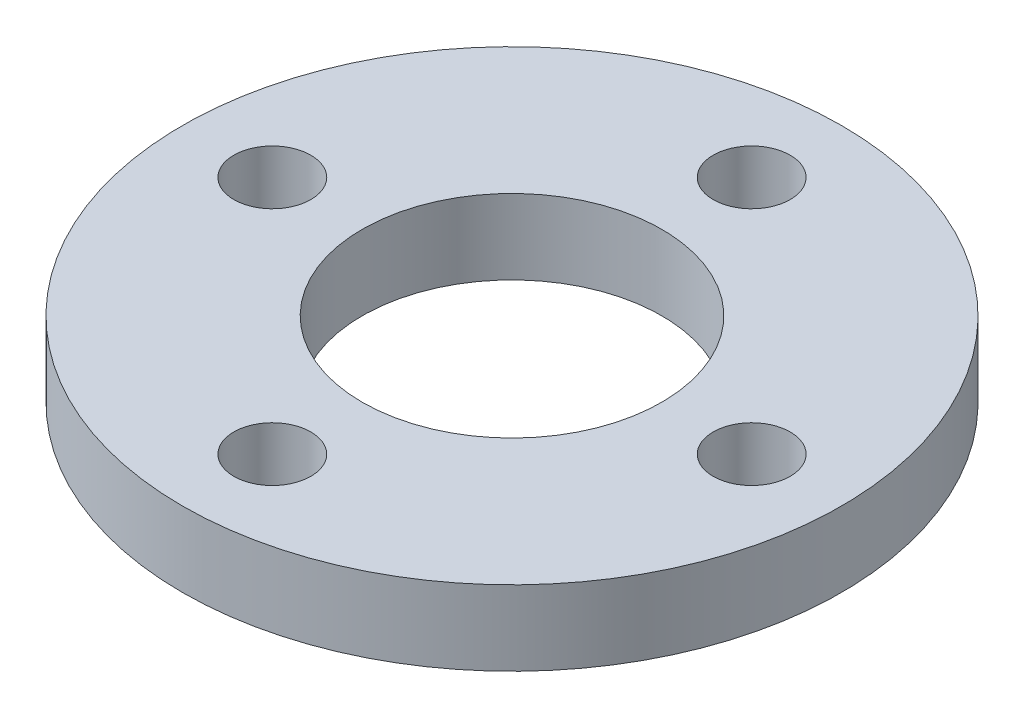
ISO-10303-21;
HEADER;
FILE_DESCRIPTION(('STEP AP214'),'2;1');
FILE_NAME('part.step','',(''),(''),'','','');
FILE_SCHEMA(('AUTOMOTIVE_DESIGN { 1 0 10303 214 1 1 1 1 }'));
ENDSEC;
DATA;
#1=APPLICATION_CONTEXT('core data for automotive mechanical design processes');
#2=APPLICATION_PROTOCOL_DEFINITION('international standard','automotive_design',2000,#1);
#3=PRODUCT_CONTEXT('',#1,'mechanical');
#4=PRODUCT('Part','Part','',(#3));
#5=PRODUCT_RELATED_PRODUCT_CATEGORY('part','',(#4));
#6=PRODUCT_DEFINITION_FORMATION('','',#4);
#7=PRODUCT_DEFINITION_CONTEXT('part definition',#1,'design');
#8=PRODUCT_DEFINITION('design','',#6,#7);
#9=PRODUCT_DEFINITION_SHAPE('','',#8);
#10=(LENGTH_UNIT() NAMED_UNIT(*) SI_UNIT(.MILLI.,.METRE.));
#11=(NAMED_UNIT(*) PLANE_ANGLE_UNIT() SI_UNIT($,.RADIAN.));
#12=(NAMED_UNIT(*) SI_UNIT($,.STERADIAN.) SOLID_ANGLE_UNIT());
#13=UNCERTAINTY_MEASURE_WITH_UNIT(LENGTH_MEASURE(1.E-05),#10,'distance_accuracy_value','');
#14=(GEOMETRIC_REPRESENTATION_CONTEXT(3) GLOBAL_UNCERTAINTY_ASSIGNED_CONTEXT((#13)) GLOBAL_UNIT_ASSIGNED_CONTEXT((#10,
#11,#12)) REPRESENTATION_CONTEXT('',''));
#15=CARTESIAN_POINT('',(0.,0.,0.));
#16=DIRECTION('',(0.,0.,1.));
#17=DIRECTION('',(1.,0.,0.));
#18=AXIS2_PLACEMENT_3D('',#15,#16,#17);
#19=CARTESIAN_POINT('',(0.,3.175,0.));
#20=DIRECTION('',(0.,-1.,0.));
#21=DIRECTION('',(0.,0.,-1.));
#22=AXIS2_PLACEMENT_3D('',#19,#20,#21);
#23=CYLINDRICAL_SURFACE('',#22,13.97);
#24=CARTESIAN_POINT('',(0.,3.175,0.));
#25=DIRECTION('',(0.,1.,0.));
#26=DIRECTION('',(0.,0.,1.));
#27=AXIS2_PLACEMENT_3D('',#24,#25,#26);
#28=CIRCLE('',#27,13.97);
#29=CARTESIAN_POINT('',(0.,3.175,13.97));
#30=VERTEX_POINT('',#29);
#31=EDGE_CURVE('E10',#30,#30,#28,.T.);
#32=ORIENTED_EDGE('',*,*,#31,.F.);
#33=EDGE_LOOP('',(#32));
#34=FACE_BOUND('',#33,.T.);
#35=CARTESIAN_POINT('',(0.,0.,0.));
#36=DIRECTION('',(0.,1.,0.));
#37=DIRECTION('',(0.,0.,1.));
#38=AXIS2_PLACEMENT_3D('',#35,#36,#37);
#39=CIRCLE('',#38,13.97);
#40=CARTESIAN_POINT('',(0.,0.,13.97));
#41=VERTEX_POINT('',#40);
#42=EDGE_CURVE('E34',#41,#41,#39,.T.);
#43=ORIENTED_EDGE('',*,*,#42,.T.);
#44=EDGE_LOOP('',(#43));
#45=FACE_BOUND('',#44,.T.);
#46=ADVANCED_FACE('F31',(#34,#45),#23,.T.);
#47=CARTESIAN_POINT('',(0.,3.175,0.));
#48=DIRECTION('',(0.,1.,0.));
#49=DIRECTION('',(0.,0.,1.));
#50=AXIS2_PLACEMENT_3D('',#47,#48,#49);
#51=PLANE('',#50);
#52=CARTESIAN_POINT('',(1.06420351207939E-13,3.175,10.16));
#53=DIRECTION('',(0.,1.,0.));
#54=DIRECTION('',(0.,0.,1.));
#55=AXIS2_PLACEMENT_3D('',#52,#53,#54);
#56=CIRCLE('',#55,1.63195);
#57=CARTESIAN_POINT('',(1.06420351207939E-13,3.175,11.79195));
#58=VERTEX_POINT('',#57);
#59=EDGE_CURVE('E69',#58,#58,#56,.T.);
#60=ORIENTED_EDGE('',*,*,#59,.F.);
#61=EDGE_LOOP('',(#60));
#62=FACE_BOUND('',#61,.T.);
#63=CARTESIAN_POINT('',(-10.16,3.175,0.));
#64=DIRECTION('',(0.,1.,0.));
#65=DIRECTION('',(0.,0.,1.));
#66=AXIS2_PLACEMENT_3D('',#63,#64,#65);
#67=CIRCLE('',#66,1.63195);
#68=CARTESIAN_POINT('',(-10.16,3.175,1.63195));
#69=VERTEX_POINT('',#68);
#70=EDGE_CURVE('E63',#69,#69,#67,.T.);
#71=ORIENTED_EDGE('',*,*,#70,.F.);
#72=EDGE_LOOP('',(#71));
#73=FACE_BOUND('',#72,.T.);
#74=CARTESIAN_POINT('',(0.,3.175,-10.16));
#75=DIRECTION('',(0.,1.,0.));
#76=DIRECTION('',(0.,0.,1.));
#77=AXIS2_PLACEMENT_3D('',#74,#75,#76);
#78=CIRCLE('',#77,1.63195);
#79=CARTESIAN_POINT('',(0.,3.175,-8.52805));
#80=VERTEX_POINT('',#79);
#81=EDGE_CURVE('E57',#80,#80,#78,.T.);
#82=ORIENTED_EDGE('',*,*,#81,.F.);
#83=EDGE_LOOP('',(#82));
#84=FACE_BOUND('',#83,.T.);
#85=CARTESIAN_POINT('',(10.16,3.175,0.));
#86=DIRECTION('',(0.,1.,0.));
#87=DIRECTION('',(0.,0.,1.));
#88=AXIS2_PLACEMENT_3D('',#85,#86,#87);
#89=CIRCLE('',#88,1.63195);
#90=CARTESIAN_POINT('',(10.16,3.175,1.63195));
#91=VERTEX_POINT('',#90);
#92=EDGE_CURVE('E51',#91,#91,#89,.T.);
#93=ORIENTED_EDGE('',*,*,#92,.F.);
#94=EDGE_LOOP('',(#93));
#95=FACE_BOUND('',#94,.T.);
#96=CARTESIAN_POINT('',(0.,3.175,0.));
#97=DIRECTION('',(0.,1.,0.));
#98=DIRECTION('',(0.,0.,1.));
#99=AXIS2_PLACEMENT_3D('',#96,#97,#98);
#100=CIRCLE('',#99,6.35);
#101=CARTESIAN_POINT('',(0.,3.175,6.35));
#102=VERTEX_POINT('',#101);
#103=EDGE_CURVE('E43',#102,#102,#100,.T.);
#104=ORIENTED_EDGE('',*,*,#103,.F.);
#105=EDGE_LOOP('',(#104));
#106=FACE_BOUND('',#105,.T.);
#107=ORIENTED_EDGE('',*,*,#31,.T.);
#108=EDGE_LOOP('',(#107));
#109=FACE_BOUND('',#108,.T.);
#110=ADVANCED_FACE('F76',(#62,#73,#84,#95,#106,#109),#51,.T.);
#111=CARTESIAN_POINT('',(0.,0.,0.));
#112=DIRECTION('',(0.,1.,0.));
#113=DIRECTION('',(0.,0.,1.));
#114=AXIS2_PLACEMENT_3D('',#111,#112,#113);
#115=PLANE('',#114);
#116=CARTESIAN_POINT('',(1.06420351207939E-13,0.,10.16));
#117=DIRECTION('',(0.,1.,0.));
#118=DIRECTION('',(0.,0.,1.));
#119=AXIS2_PLACEMENT_3D('',#116,#117,#118);
#120=CIRCLE('',#119,1.63195);
#121=CARTESIAN_POINT('',(1.06420351207939E-13,0.,11.79195));
#122=VERTEX_POINT('',#121);
#123=EDGE_CURVE('E66',#122,#122,#120,.T.);
#124=ORIENTED_EDGE('',*,*,#123,.T.);
#125=EDGE_LOOP('',(#124));
#126=FACE_BOUND('',#125,.T.);
#127=CARTESIAN_POINT('',(-10.16,0.,0.));
#128=DIRECTION('',(0.,1.,0.));
#129=DIRECTION('',(0.,0.,1.));
#130=AXIS2_PLACEMENT_3D('',#127,#128,#129);
#131=CIRCLE('',#130,1.63195);
#132=CARTESIAN_POINT('',(-10.16,0.,1.63195));
#133=VERTEX_POINT('',#132);
#134=EDGE_CURVE('E60',#133,#133,#131,.T.);
#135=ORIENTED_EDGE('',*,*,#134,.T.);
#136=EDGE_LOOP('',(#135));
#137=FACE_BOUND('',#136,.T.);
#138=CARTESIAN_POINT('',(0.,0.,-10.16));
#139=DIRECTION('',(0.,1.,0.));
#140=DIRECTION('',(0.,0.,1.));
#141=AXIS2_PLACEMENT_3D('',#138,#139,#140);
#142=CIRCLE('',#141,1.63195);
#143=CARTESIAN_POINT('',(0.,0.,-8.52805));
#144=VERTEX_POINT('',#143);
#145=EDGE_CURVE('E54',#144,#144,#142,.T.);
#146=ORIENTED_EDGE('',*,*,#145,.T.);
#147=EDGE_LOOP('',(#146));
#148=FACE_BOUND('',#147,.T.);
#149=CARTESIAN_POINT('',(10.16,0.,0.));
#150=DIRECTION('',(0.,1.,0.));
#151=DIRECTION('',(0.,0.,1.));
#152=AXIS2_PLACEMENT_3D('',#149,#150,#151);
#153=CIRCLE('',#152,1.63195);
#154=CARTESIAN_POINT('',(10.16,0.,1.63195));
#155=VERTEX_POINT('',#154);
#156=EDGE_CURVE('E46',#155,#155,#153,.T.);
#157=ORIENTED_EDGE('',*,*,#156,.T.);
#158=EDGE_LOOP('',(#157));
#159=FACE_BOUND('',#158,.T.);
#160=CARTESIAN_POINT('',(0.,0.,0.));
#161=DIRECTION('',(0.,1.,0.));
#162=DIRECTION('',(0.,0.,1.));
#163=AXIS2_PLACEMENT_3D('',#160,#161,#162);
#164=CIRCLE('',#163,6.35);
#165=CARTESIAN_POINT('',(0.,0.,6.35));
#166=VERTEX_POINT('',#165);
#167=EDGE_CURVE('E41',#166,#166,#164,.T.);
#168=ORIENTED_EDGE('',*,*,#167,.T.);
#169=EDGE_LOOP('',(#168));
#170=FACE_BOUND('',#169,.T.);
#171=ORIENTED_EDGE('',*,*,#42,.F.);
#172=EDGE_LOOP('',(#171));
#173=FACE_BOUND('',#172,.T.);
#174=ADVANCED_FACE('F79',(#126,#137,#148,#159,#170,#173),#115,.F.);
#175=CARTESIAN_POINT('',(0.,0.,0.));
#176=DIRECTION('',(0.,1.,0.));
#177=DIRECTION('',(0.,0.,1.));
#178=AXIS2_PLACEMENT_3D('',#175,#176,#177);
#179=CYLINDRICAL_SURFACE('',#178,6.35);
#180=ORIENTED_EDGE('',*,*,#167,.F.);
#181=EDGE_LOOP('',(#180));
#182=FACE_BOUND('',#181,.T.);
#183=ORIENTED_EDGE('',*,*,#103,.T.);
#184=EDGE_LOOP('',(#183));
#185=FACE_BOUND('',#184,.T.);
#186=ADVANCED_FACE('F89',(#182,#185),#179,.F.);
#187=CARTESIAN_POINT('',(10.16,3.175,0.));
#188=DIRECTION('',(0.,1.,0.));
#189=DIRECTION('',(0.,0.,1.));
#190=AXIS2_PLACEMENT_3D('',#187,#188,#189);
#191=CYLINDRICAL_SURFACE('',#190,1.63195);
#192=ORIENTED_EDGE('',*,*,#92,.T.);
#193=EDGE_LOOP('',(#192));
#194=FACE_BOUND('',#193,.T.);
#195=ORIENTED_EDGE('',*,*,#156,.F.);
#196=EDGE_LOOP('',(#195));
#197=FACE_BOUND('',#196,.T.);
#198=ADVANCED_FACE('F91',(#194,#197),#191,.F.);
#199=CARTESIAN_POINT('',(0.,3.175,-10.16));
#200=DIRECTION('',(0.,1.,0.));
#201=DIRECTION('',(0.,0.,1.));
#202=AXIS2_PLACEMENT_3D('',#199,#200,#201);
#203=CYLINDRICAL_SURFACE('',#202,1.63195);
#204=ORIENTED_EDGE('',*,*,#81,.T.);
#205=EDGE_LOOP('',(#204));
#206=FACE_BOUND('',#205,.T.);
#207=ORIENTED_EDGE('',*,*,#145,.F.);
#208=EDGE_LOOP('',(#207));
#209=FACE_BOUND('',#208,.T.);
#210=ADVANCED_FACE('F98',(#206,#209),#203,.F.);
#211=CARTESIAN_POINT('',(-10.16,3.175,0.));
#212=DIRECTION('',(0.,1.,0.));
#213=DIRECTION('',(0.,0.,1.));
#214=AXIS2_PLACEMENT_3D('',#211,#212,#213);
#215=CYLINDRICAL_SURFACE('',#214,1.63195);
#216=ORIENTED_EDGE('',*,*,#70,.T.);
#217=EDGE_LOOP('',(#216));
#218=FACE_BOUND('',#217,.T.);
#219=ORIENTED_EDGE('',*,*,#134,.F.);
#220=EDGE_LOOP('',(#219));
#221=FACE_BOUND('',#220,.T.);
#222=ADVANCED_FACE('F129',(#218,#221),#215,.F.);
#223=CARTESIAN_POINT('',(1.06420351207939E-13,3.175,10.16));
#224=DIRECTION('',(0.,1.,0.));
#225=DIRECTION('',(0.,0.,1.));
#226=AXIS2_PLACEMENT_3D('',#223,#224,#225);
#227=CYLINDRICAL_SURFACE('',#226,1.63195);
#228=ORIENTED_EDGE('',*,*,#59,.T.);
#229=EDGE_LOOP('',(#228));
#230=FACE_BOUND('',#229,.T.);
#231=ORIENTED_EDGE('',*,*,#123,.F.);
#232=EDGE_LOOP('',(#231));
#233=FACE_BOUND('',#232,.T.);
#234=ADVANCED_FACE('F73',(#230,#233),#227,.F.);
#235=CLOSED_SHELL('',(#46,#110,#174,#186,#198,#210,#222,#234));
#236=MANIFOLD_SOLID_BREP('B2',#235);
#237=ADVANCED_BREP_SHAPE_REPRESENTATION('',(#18,#236),#14);
#238=SHAPE_DEFINITION_REPRESENTATION(#9,#237);
ENDSEC;
END-ISO-10303-21;
